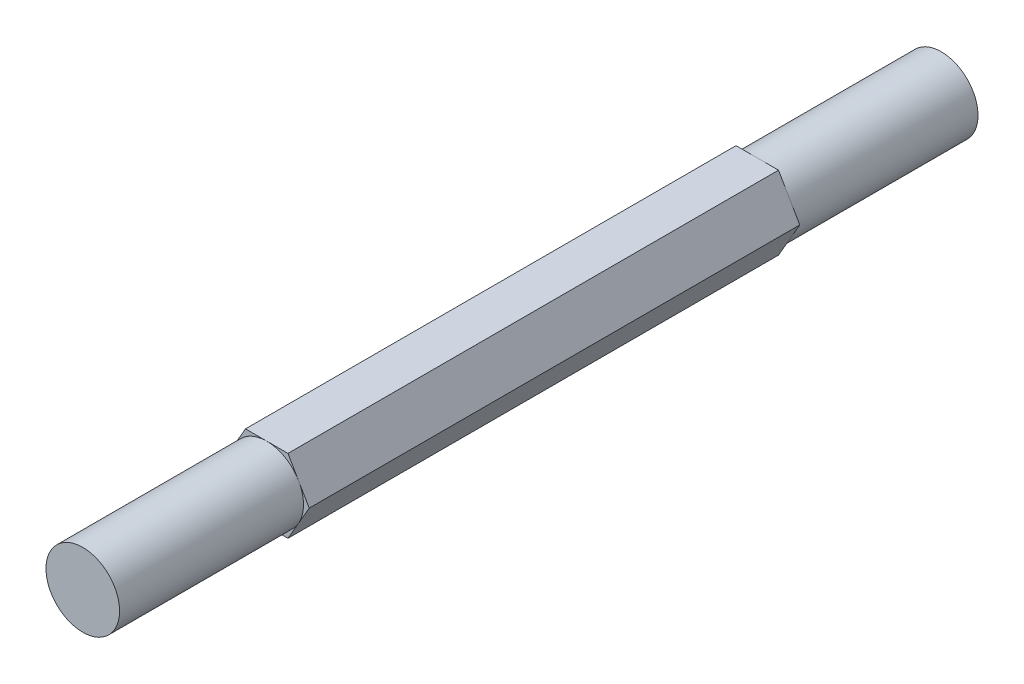
ISO-10303-21;
HEADER;
FILE_DESCRIPTION(('STEP AP214'),'2;1');
FILE_NAME('part.step','',(''),(''),'','','');
FILE_SCHEMA(('AUTOMOTIVE_DESIGN { 1 0 10303 214 1 1 1 1 }'));
ENDSEC;
DATA;
#1=APPLICATION_CONTEXT('core data for automotive mechanical design processes');
#2=APPLICATION_PROTOCOL_DEFINITION('international standard','automotive_design',2000,#1);
#3=PRODUCT_CONTEXT('',#1,'mechanical');
#4=PRODUCT('Part','Part','',(#3));
#5=PRODUCT_RELATED_PRODUCT_CATEGORY('part','',(#4));
#6=PRODUCT_DEFINITION_FORMATION('','',#4);
#7=PRODUCT_DEFINITION_CONTEXT('part definition',#1,'design');
#8=PRODUCT_DEFINITION('design','',#6,#7);
#9=PRODUCT_DEFINITION_SHAPE('','',#8);
#10=(LENGTH_UNIT() NAMED_UNIT(*) SI_UNIT(.MILLI.,.METRE.));
#11=(NAMED_UNIT(*) PLANE_ANGLE_UNIT() SI_UNIT($,.RADIAN.));
#12=(NAMED_UNIT(*) SI_UNIT($,.STERADIAN.) SOLID_ANGLE_UNIT());
#13=UNCERTAINTY_MEASURE_WITH_UNIT(LENGTH_MEASURE(1.E-05),#10,'distance_accuracy_value','');
#14=(GEOMETRIC_REPRESENTATION_CONTEXT(3) GLOBAL_UNCERTAINTY_ASSIGNED_CONTEXT((#13)) GLOBAL_UNIT_ASSIGNED_CONTEXT((#10,
#11,#12)) REPRESENTATION_CONTEXT('',''));
#15=CARTESIAN_POINT('',(0.,0.,0.));
#16=DIRECTION('',(0.,0.,1.));
#17=DIRECTION('',(1.,0.,0.));
#18=AXIS2_PLACEMENT_3D('',#15,#16,#17);
#19=CARTESIAN_POINT('',(0.,0.,0.));
#20=DIRECTION('',(0.,0.,1.));
#21=DIRECTION('',(1.,0.,0.));
#22=AXIS2_PLACEMENT_3D('',#19,#20,#21);
#23=PLANE('',#22);
#24=CARTESIAN_POINT('',(0.,0.,0.));
#25=DIRECTION('',(0.,0.,-1.));
#26=DIRECTION('',(-1.,0.,0.));
#27=AXIS2_PLACEMENT_3D('',#24,#25,#26);
#28=CIRCLE('',#27,6.);
#29=CARTESIAN_POINT('',(-5.19615242270662,3.00000000000003,0.));
#30=VERTEX_POINT('',#29);
#31=CARTESIAN_POINT('',(0.,6.,0.));
#32=VERTEX_POINT('',#31);
#33=EDGE_CURVE('E45',#30,#32,#28,.T.);
#34=ORIENTED_EDGE('',*,*,#33,.F.);
#35=DIRECTION('',(-0.500000000000004,-0.866025403784436,0.));
#36=VECTOR('',#35,1.);
#37=CARTESIAN_POINT('',(-3.46410161513773,6.00000000000002,0.));
#38=LINE('',#37,#36);
#39=CARTESIAN_POINT('',(-3.46410161513773,6.00000000000002,0.));
#40=VERTEX_POINT('',#39);
#41=EDGE_CURVE('E128',#40,#30,#38,.T.);
#42=ORIENTED_EDGE('',*,*,#41,.F.);
#43=DIRECTION('',(-1.,0.,0.));
#44=VECTOR('',#43,1.);
#45=CARTESIAN_POINT('',(3.46410161513779,5.99999999999998,0.));
#46=LINE('',#45,#44);
#47=EDGE_CURVE('E145',#32,#40,#46,.T.);
#48=ORIENTED_EDGE('',*,*,#47,.F.);
#49=EDGE_LOOP('',(#34,#42,#48));
#50=FACE_BOUND('',#49,.T.);
#51=ADVANCED_FACE('F34',(#50),#23,.F.);
#52=CARTESIAN_POINT('',(5.19615242270665,2.99999999999997,0.));
#53=VERTEX_POINT('',#52);
#54=EDGE_CURVE('E11',#32,#53,#28,.T.);
#55=ORIENTED_EDGE('',*,*,#54,.F.);
#56=CARTESIAN_POINT('',(3.46410161513779,5.99999999999998,0.));
#57=VERTEX_POINT('',#56);
#58=EDGE_CURVE('E143',#57,#32,#46,.T.);
#59=ORIENTED_EDGE('',*,*,#58,.F.);
#60=DIRECTION('',(-0.499999999999995,0.866025403784441,0.));
#61=VECTOR('',#60,1.);
#62=CARTESIAN_POINT('',(6.92820323027551,0.,0.));
#63=LINE('',#62,#61);
#64=EDGE_CURVE('E163',#53,#57,#63,.T.);
#65=ORIENTED_EDGE('',*,*,#64,.F.);
#66=EDGE_LOOP('',(#55,#59,#65));
#67=FACE_BOUND('',#66,.T.);
#68=ADVANCED_FACE('F233',(#67),#23,.F.);
#69=CARTESIAN_POINT('',(5.19615242270662,-3.00000000000003,0.));
#70=VERTEX_POINT('',#69);
#71=EDGE_CURVE('E43',#53,#70,#28,.T.);
#72=ORIENTED_EDGE('',*,*,#71,.F.);
#73=CARTESIAN_POINT('',(6.92820323027551,0.,0.));
#74=VERTEX_POINT('',#73);
#75=EDGE_CURVE('E191',#74,#53,#63,.T.);
#76=ORIENTED_EDGE('',*,*,#75,.F.);
#77=DIRECTION('',(0.500000000000004,0.866025403784436,0.));
#78=VECTOR('',#77,1.);
#79=CARTESIAN_POINT('',(3.46410161513772,-6.00000000000002,0.));
#80=LINE('',#79,#78);
#81=EDGE_CURVE('E200',#70,#74,#80,.T.);
#82=ORIENTED_EDGE('',*,*,#81,.F.);
#83=EDGE_LOOP('',(#72,#76,#82));
#84=FACE_BOUND('',#83,.T.);
#85=ADVANCED_FACE('F241',(#84),#23,.F.);
#86=CARTESIAN_POINT('',(0.,-6.,0.));
#87=VERTEX_POINT('',#86);
#88=EDGE_CURVE('E154',#70,#87,#28,.T.);
#89=ORIENTED_EDGE('',*,*,#88,.F.);
#90=CARTESIAN_POINT('',(3.46410161513772,-6.00000000000002,0.));
#91=VERTEX_POINT('',#90);
#92=EDGE_CURVE('E201',#91,#70,#80,.T.);
#93=ORIENTED_EDGE('',*,*,#92,.F.);
#94=DIRECTION('',(1.,0.,0.));
#95=VECTOR('',#94,1.);
#96=CARTESIAN_POINT('',(-3.46410161513778,-5.99999999999998,0.));
#97=LINE('',#96,#95);
#98=EDGE_CURVE('E196',#87,#91,#97,.T.);
#99=ORIENTED_EDGE('',*,*,#98,.F.);
#100=EDGE_LOOP('',(#89,#93,#99));
#101=FACE_BOUND('',#100,.T.);
#102=ADVANCED_FACE('F249',(#101),#23,.F.);
#103=CARTESIAN_POINT('',(-5.19615242270665,-2.99999999999997,0.));
#104=VERTEX_POINT('',#103);
#105=EDGE_CURVE('E152',#87,#104,#28,.T.);
#106=ORIENTED_EDGE('',*,*,#105,.F.);
#107=CARTESIAN_POINT('',(-3.46410161513778,-5.99999999999998,0.));
#108=VERTEX_POINT('',#107);
#109=EDGE_CURVE('E197',#108,#87,#97,.T.);
#110=ORIENTED_EDGE('',*,*,#109,.F.);
#111=DIRECTION('',(0.499999999999996,-0.866025403784441,0.));
#112=VECTOR('',#111,1.);
#113=CARTESIAN_POINT('',(-6.92820323027551,0.,0.));
#114=LINE('',#113,#112);
#115=EDGE_CURVE('E138',#104,#108,#114,.T.);
#116=ORIENTED_EDGE('',*,*,#115,.F.);
#117=EDGE_LOOP('',(#106,#110,#116));
#118=FACE_BOUND('',#117,.T.);
#119=ADVANCED_FACE('F256',(#118),#23,.F.);
#120=CARTESIAN_POINT('',(0.,0.,80.));
#121=DIRECTION('',(0.,0.,1.));
#122=DIRECTION('',(1.,0.,0.));
#123=AXIS2_PLACEMENT_3D('',#120,#121,#122);
#124=PLANE('',#123);
#125=CARTESIAN_POINT('',(0.,0.,80.));
#126=DIRECTION('',(0.,0.,1.));
#127=DIRECTION('',(1.,0.,0.));
#128=AXIS2_PLACEMENT_3D('',#125,#126,#127);
#129=CIRCLE('',#128,6.);
#130=CARTESIAN_POINT('',(5.19615242270665,2.99999999999997,80.));
#131=VERTEX_POINT('',#130);
#132=CARTESIAN_POINT('',(0.,6.,80.));
#133=VERTEX_POINT('',#132);
#134=EDGE_CURVE('E158',#131,#133,#129,.T.);
#135=ORIENTED_EDGE('',*,*,#134,.F.);
#136=DIRECTION('',(-0.499999999999995,0.866025403784441,0.));
#137=VECTOR('',#136,1.);
#138=CARTESIAN_POINT('',(6.92820323027551,0.,80.));
#139=LINE('',#138,#137);
#140=CARTESIAN_POINT('',(3.46410161513779,5.99999999999998,80.));
#141=VERTEX_POINT('',#140);
#142=EDGE_CURVE('E170',#131,#141,#139,.T.);
#143=ORIENTED_EDGE('',*,*,#142,.T.);
#144=DIRECTION('',(-1.,0.,0.));
#145=VECTOR('',#144,1.);
#146=CARTESIAN_POINT('',(3.46410161513779,5.99999999999998,80.));
#147=LINE('',#146,#145);
#148=EDGE_CURVE('E171',#141,#133,#147,.T.);
#149=ORIENTED_EDGE('',*,*,#148,.T.);
#150=EDGE_LOOP('',(#135,#143,#149));
#151=FACE_BOUND('',#150,.T.);
#152=ADVANCED_FACE('F271',(#151),#124,.T.);
#153=CARTESIAN_POINT('',(-5.19615242270662,3.00000000000003,80.));
#154=VERTEX_POINT('',#153);
#155=EDGE_CURVE('E153',#133,#154,#129,.T.);
#156=ORIENTED_EDGE('',*,*,#155,.F.);
#157=CARTESIAN_POINT('',(-3.46410161513773,6.00000000000002,80.));
#158=VERTEX_POINT('',#157);
#159=EDGE_CURVE('E169',#133,#158,#147,.T.);
#160=ORIENTED_EDGE('',*,*,#159,.T.);
#161=DIRECTION('',(-0.500000000000004,-0.866025403784436,0.));
#162=VECTOR('',#161,1.);
#163=CARTESIAN_POINT('',(-3.46410161513773,6.00000000000002,80.));
#164=LINE('',#163,#162);
#165=EDGE_CURVE('E175',#158,#154,#164,.T.);
#166=ORIENTED_EDGE('',*,*,#165,.T.);
#167=EDGE_LOOP('',(#156,#160,#166));
#168=FACE_BOUND('',#167,.T.);
#169=ADVANCED_FACE('F230',(#168),#124,.T.);
#170=CARTESIAN_POINT('',(-5.19615242270665,-2.99999999999997,80.));
#171=VERTEX_POINT('',#170);
#172=EDGE_CURVE('E156',#154,#171,#129,.T.);
#173=ORIENTED_EDGE('',*,*,#172,.F.);
#174=CARTESIAN_POINT('',(-6.92820323027551,0.,80.));
#175=VERTEX_POINT('',#174);
#176=EDGE_CURVE('E174',#154,#175,#164,.T.);
#177=ORIENTED_EDGE('',*,*,#176,.T.);
#178=DIRECTION('',(0.499999999999996,-0.866025403784441,0.));
#179=VECTOR('',#178,1.);
#180=CARTESIAN_POINT('',(-6.92820323027551,0.,80.));
#181=LINE('',#180,#179);
#182=EDGE_CURVE('E179',#175,#171,#181,.T.);
#183=ORIENTED_EDGE('',*,*,#182,.T.);
#184=EDGE_LOOP('',(#173,#177,#183));
#185=FACE_BOUND('',#184,.T.);
#186=ADVANCED_FACE('F227',(#185),#124,.T.);
#187=CARTESIAN_POINT('',(0.,-6.,80.));
#188=VERTEX_POINT('',#187);
#189=EDGE_CURVE('E221',#171,#188,#129,.T.);
#190=ORIENTED_EDGE('',*,*,#189,.F.);
#191=CARTESIAN_POINT('',(-3.46410161513778,-5.99999999999998,80.));
#192=VERTEX_POINT('',#191);
#193=EDGE_CURVE('E178',#171,#192,#181,.T.);
#194=ORIENTED_EDGE('',*,*,#193,.T.);
#195=DIRECTION('',(1.,0.,0.));
#196=VECTOR('',#195,1.);
#197=CARTESIAN_POINT('',(-3.46410161513778,-5.99999999999998,80.));
#198=LINE('',#197,#196);
#199=EDGE_CURVE('E183',#192,#188,#198,.T.);
#200=ORIENTED_EDGE('',*,*,#199,.T.);
#201=EDGE_LOOP('',(#190,#194,#200));
#202=FACE_BOUND('',#201,.T.);
#203=ADVANCED_FACE('F261',(#202),#124,.T.);
#204=CARTESIAN_POINT('',(5.19615242270662,-3.00000000000003,80.));
#205=VERTEX_POINT('',#204);
#206=EDGE_CURVE('E218',#188,#205,#129,.T.);
#207=ORIENTED_EDGE('',*,*,#206,.F.);
#208=CARTESIAN_POINT('',(3.46410161513772,-6.00000000000002,80.));
#209=VERTEX_POINT('',#208);
#210=EDGE_CURVE('E182',#188,#209,#198,.T.);
#211=ORIENTED_EDGE('',*,*,#210,.T.);
#212=DIRECTION('',(0.500000000000004,0.866025403784436,0.));
#213=VECTOR('',#212,1.);
#214=CARTESIAN_POINT('',(3.46410161513772,-6.00000000000002,80.));
#215=LINE('',#214,#213);
#216=EDGE_CURVE('E187',#209,#205,#215,.T.);
#217=ORIENTED_EDGE('',*,*,#216,.T.);
#218=EDGE_LOOP('',(#207,#211,#217));
#219=FACE_BOUND('',#218,.T.);
#220=ADVANCED_FACE('F264',(#219),#124,.T.);
#221=CARTESIAN_POINT('',(6.92820323027551,0.,80.));
#222=DIRECTION('',(-0.866025403784441,-0.499999999999995,0.));
#223=DIRECTION('',(0.499999999999995,-0.866025403784441,0.));
#224=AXIS2_PLACEMENT_3D('',#221,#222,#223);
#225=PLANE('',#224);
#226=ORIENTED_EDGE('',*,*,#75,.T.);
#227=ORIENTED_EDGE('',*,*,#64,.T.);
#228=DIRECTION('',(0.,0.,-1.));
#229=VECTOR('',#228,1.);
#230=CARTESIAN_POINT('',(3.46410161513779,5.99999999999998,80.));
#231=LINE('',#230,#229);
#232=EDGE_CURVE('E38',#141,#57,#231,.T.);
#233=ORIENTED_EDGE('',*,*,#232,.F.);
#234=ORIENTED_EDGE('',*,*,#142,.F.);
#235=CARTESIAN_POINT('',(6.92820323027551,0.,80.));
#236=VERTEX_POINT('',#235);
#237=EDGE_CURVE('E167',#236,#131,#139,.T.);
#238=ORIENTED_EDGE('',*,*,#237,.F.);
#239=DIRECTION('',(0.,0.,-1.));
#240=VECTOR('',#239,1.);
#241=CARTESIAN_POINT('',(6.92820323027551,0.,80.));
#242=LINE('',#241,#240);
#243=EDGE_CURVE('E190',#236,#74,#242,.T.);
#244=ORIENTED_EDGE('',*,*,#243,.T.);
#245=EDGE_LOOP('',(#226,#227,#233,#234,#238,#244));
#246=FACE_BOUND('',#245,.T.);
#247=ADVANCED_FACE('F36',(#246),#225,.F.);
#248=CARTESIAN_POINT('',(3.46410161513779,5.99999999999998,80.));
#249=DIRECTION('',(0.,-1.,0.));
#250=DIRECTION('',(1.,0.,0.));
#251=AXIS2_PLACEMENT_3D('',#248,#249,#250);
#252=PLANE('',#251);
#253=ORIENTED_EDGE('',*,*,#58,.T.);
#254=ORIENTED_EDGE('',*,*,#47,.T.);
#255=DIRECTION('',(0.,0.,-1.));
#256=VECTOR('',#255,1.);
#257=CARTESIAN_POINT('',(-3.46410161513773,6.00000000000002,80.));
#258=LINE('',#257,#256);
#259=EDGE_CURVE('E135',#158,#40,#258,.T.);
#260=ORIENTED_EDGE('',*,*,#259,.F.);
#261=ORIENTED_EDGE('',*,*,#159,.F.);
#262=ORIENTED_EDGE('',*,*,#148,.F.);
#263=ORIENTED_EDGE('',*,*,#232,.T.);
#264=EDGE_LOOP('',(#253,#254,#260,#261,#262,#263));
#265=FACE_BOUND('',#264,.T.);
#266=ADVANCED_FACE('F232',(#265),#252,.F.);
#267=CARTESIAN_POINT('',(-3.46410161513773,6.00000000000002,80.));
#268=DIRECTION('',(0.866025403784436,-0.500000000000004,0.));
#269=DIRECTION('',(0.500000000000004,0.866025403784436,0.));
#270=AXIS2_PLACEMENT_3D('',#267,#268,#269);
#271=PLANE('',#270);
#272=ORIENTED_EDGE('',*,*,#41,.T.);
#273=CARTESIAN_POINT('',(-6.92820323027551,0.,0.));
#274=VERTEX_POINT('',#273);
#275=EDGE_CURVE('E131',#30,#274,#38,.T.);
#276=ORIENTED_EDGE('',*,*,#275,.T.);
#277=DIRECTION('',(0.,0.,-1.));
#278=VECTOR('',#277,1.);
#279=CARTESIAN_POINT('',(-6.92820323027551,0.,80.));
#280=LINE('',#279,#278);
#281=EDGE_CURVE('E212',#175,#274,#280,.T.);
#282=ORIENTED_EDGE('',*,*,#281,.F.);
#283=ORIENTED_EDGE('',*,*,#176,.F.);
#284=ORIENTED_EDGE('',*,*,#165,.F.);
#285=ORIENTED_EDGE('',*,*,#259,.T.);
#286=EDGE_LOOP('',(#272,#276,#282,#283,#284,#285));
#287=FACE_BOUND('',#286,.T.);
#288=ADVANCED_FACE('F129',(#287),#271,.F.);
#289=CARTESIAN_POINT('',(-6.92820323027551,0.,80.));
#290=DIRECTION('',(0.866025403784441,0.499999999999996,0.));
#291=DIRECTION('',(-0.499999999999996,0.866025403784441,0.));
#292=AXIS2_PLACEMENT_3D('',#289,#290,#291);
#293=PLANE('',#292);
#294=EDGE_CURVE('E142',#274,#104,#114,.T.);
#295=ORIENTED_EDGE('',*,*,#294,.T.);
#296=ORIENTED_EDGE('',*,*,#115,.T.);
#297=DIRECTION('',(0.,0.,-1.));
#298=VECTOR('',#297,1.);
#299=CARTESIAN_POINT('',(-3.46410161513778,-5.99999999999998,80.));
#300=LINE('',#299,#298);
#301=EDGE_CURVE('E209',#192,#108,#300,.T.);
#302=ORIENTED_EDGE('',*,*,#301,.F.);
#303=ORIENTED_EDGE('',*,*,#193,.F.);
#304=ORIENTED_EDGE('',*,*,#182,.F.);
#305=ORIENTED_EDGE('',*,*,#281,.T.);
#306=EDGE_LOOP('',(#295,#296,#302,#303,#304,#305));
#307=FACE_BOUND('',#306,.T.);
#308=ADVANCED_FACE('F258',(#307),#293,.F.);
#309=CARTESIAN_POINT('',(-3.46410161513778,-5.99999999999998,80.));
#310=DIRECTION('',(0.,1.,0.));
#311=DIRECTION('',(-1.,0.,0.));
#312=AXIS2_PLACEMENT_3D('',#309,#310,#311);
#313=PLANE('',#312);
#314=ORIENTED_EDGE('',*,*,#109,.T.);
#315=ORIENTED_EDGE('',*,*,#98,.T.);
#316=DIRECTION('',(0.,0.,-1.));
#317=VECTOR('',#316,1.);
#318=CARTESIAN_POINT('',(3.46410161513772,-6.00000000000002,80.));
#319=LINE('',#318,#317);
#320=EDGE_CURVE('E206',#209,#91,#319,.T.);
#321=ORIENTED_EDGE('',*,*,#320,.F.);
#322=ORIENTED_EDGE('',*,*,#210,.F.);
#323=ORIENTED_EDGE('',*,*,#199,.F.);
#324=ORIENTED_EDGE('',*,*,#301,.T.);
#325=EDGE_LOOP('',(#314,#315,#321,#322,#323,#324));
#326=FACE_BOUND('',#325,.T.);
#327=ADVANCED_FACE('F252',(#326),#313,.F.);
#328=CARTESIAN_POINT('',(3.46410161513772,-6.00000000000002,80.));
#329=DIRECTION('',(-0.866025403784436,0.500000000000004,0.));
#330=DIRECTION('',(-0.500000000000004,-0.866025403784436,0.));
#331=AXIS2_PLACEMENT_3D('',#328,#329,#330);
#332=PLANE('',#331);
#333=ORIENTED_EDGE('',*,*,#92,.T.);
#334=ORIENTED_EDGE('',*,*,#81,.T.);
#335=ORIENTED_EDGE('',*,*,#243,.F.);
#336=EDGE_CURVE('E186',#205,#236,#215,.T.);
#337=ORIENTED_EDGE('',*,*,#336,.F.);
#338=ORIENTED_EDGE('',*,*,#216,.F.);
#339=ORIENTED_EDGE('',*,*,#320,.T.);
#340=EDGE_LOOP('',(#333,#334,#335,#337,#338,#339));
#341=FACE_BOUND('',#340,.T.);
#342=ADVANCED_FACE('F244',(#341),#332,.F.);
#343=EDGE_CURVE('E166',#205,#131,#129,.T.);
#344=ORIENTED_EDGE('',*,*,#343,.F.);
#345=ORIENTED_EDGE('',*,*,#336,.T.);
#346=ORIENTED_EDGE('',*,*,#237,.T.);
#347=EDGE_LOOP('',(#344,#345,#346));
#348=FACE_BOUND('',#347,.T.);
#349=ADVANCED_FACE('F267',(#348),#124,.T.);
#350=EDGE_CURVE('E58',#104,#30,#28,.T.);
#351=ORIENTED_EDGE('',*,*,#350,.F.);
#352=ORIENTED_EDGE('',*,*,#294,.F.);
#353=ORIENTED_EDGE('',*,*,#275,.F.);
#354=EDGE_LOOP('',(#351,#352,#353));
#355=FACE_BOUND('',#354,.T.);
#356=ADVANCED_FACE('F140',(#355),#23,.F.);
#357=CARTESIAN_POINT('',(0.,0.,110.));
#358=DIRECTION('',(0.,0.,-1.));
#359=DIRECTION('',(-1.,0.,0.));
#360=AXIS2_PLACEMENT_3D('',#357,#358,#359);
#361=CYLINDRICAL_SURFACE('',#360,6.);
#362=CARTESIAN_POINT('',(0.,0.,110.));
#363=DIRECTION('',(0.,0.,1.));
#364=DIRECTION('',(1.,0.,0.));
#365=AXIS2_PLACEMENT_3D('',#362,#363,#364);
#366=CIRCLE('',#365,6.);
#367=CARTESIAN_POINT('',(6.,0.,110.));
#368=VERTEX_POINT('',#367);
#369=EDGE_CURVE('E161',#368,#368,#366,.T.);
#370=ORIENTED_EDGE('',*,*,#369,.F.);
#371=EDGE_LOOP('',(#370));
#372=FACE_BOUND('',#371,.T.);
#373=ORIENTED_EDGE('',*,*,#134,.T.);
#374=ORIENTED_EDGE('',*,*,#155,.T.);
#375=ORIENTED_EDGE('',*,*,#172,.T.);
#376=ORIENTED_EDGE('',*,*,#189,.T.);
#377=ORIENTED_EDGE('',*,*,#206,.T.);
#378=ORIENTED_EDGE('',*,*,#343,.T.);
#379=EDGE_LOOP('',(#373,#374,#375,#376,#377,#378));
#380=FACE_BOUND('',#379,.T.);
#381=ADVANCED_FACE('F224',(#372,#380),#361,.T.);
#382=CARTESIAN_POINT('',(0.,0.,110.));
#383=DIRECTION('',(0.,0.,1.));
#384=DIRECTION('',(1.,0.,0.));
#385=AXIS2_PLACEMENT_3D('',#382,#383,#384);
#386=PLANE('',#385);
#387=ORIENTED_EDGE('',*,*,#369,.T.);
#388=EDGE_LOOP('',(#387));
#389=FACE_BOUND('',#388,.T.);
#390=ADVANCED_FACE('F290',(#389),#386,.T.);
#391=CARTESIAN_POINT('',(0.,0.,-30.));
#392=DIRECTION('',(0.,0.,1.));
#393=DIRECTION('',(1.,0.,0.));
#394=AXIS2_PLACEMENT_3D('',#391,#392,#393);
#395=CYLINDRICAL_SURFACE('',#394,6.);
#396=CARTESIAN_POINT('',(0.,0.,-30.));
#397=DIRECTION('',(0.,0.,-1.));
#398=DIRECTION('',(-1.,0.,0.));
#399=AXIS2_PLACEMENT_3D('',#396,#397,#398);
#400=CIRCLE('',#399,6.);
#401=CARTESIAN_POINT('',(-6.,0.,-30.));
#402=VERTEX_POINT('',#401);
#403=EDGE_CURVE('E148',#402,#402,#400,.T.);
#404=ORIENTED_EDGE('',*,*,#403,.F.);
#405=EDGE_LOOP('',(#404));
#406=FACE_BOUND('',#405,.T.);
#407=ORIENTED_EDGE('',*,*,#33,.T.);
#408=ORIENTED_EDGE('',*,*,#54,.T.);
#409=ORIENTED_EDGE('',*,*,#71,.T.);
#410=ORIENTED_EDGE('',*,*,#88,.T.);
#411=ORIENTED_EDGE('',*,*,#105,.T.);
#412=ORIENTED_EDGE('',*,*,#350,.T.);
#413=EDGE_LOOP('',(#407,#408,#409,#410,#411,#412));
#414=FACE_BOUND('',#413,.T.);
#415=ADVANCED_FACE('F150',(#406,#414),#395,.T.);
#416=CARTESIAN_POINT('',(0.,0.,-30.));
#417=DIRECTION('',(0.,0.,-1.));
#418=DIRECTION('',(-1.,0.,0.));
#419=AXIS2_PLACEMENT_3D('',#416,#417,#418);
#420=PLANE('',#419);
#421=ORIENTED_EDGE('',*,*,#403,.T.);
#422=EDGE_LOOP('',(#421));
#423=FACE_BOUND('',#422,.T.);
#424=ADVANCED_FACE('F301',(#423),#420,.T.);
#425=CLOSED_SHELL('',(#51,#68,#85,#102,#119,#152,#169,#186,#203,#220,#247,#266,#288,#308,#327,
#342,#349,#356,#381,#390,#415,#424));
#426=MANIFOLD_SOLID_BREP('B2',#425);
#427=ADVANCED_BREP_SHAPE_REPRESENTATION('',(#18,#426),#14);
#428=SHAPE_DEFINITION_REPRESENTATION(#9,#427);
ENDSEC;
END-ISO-10303-21;
